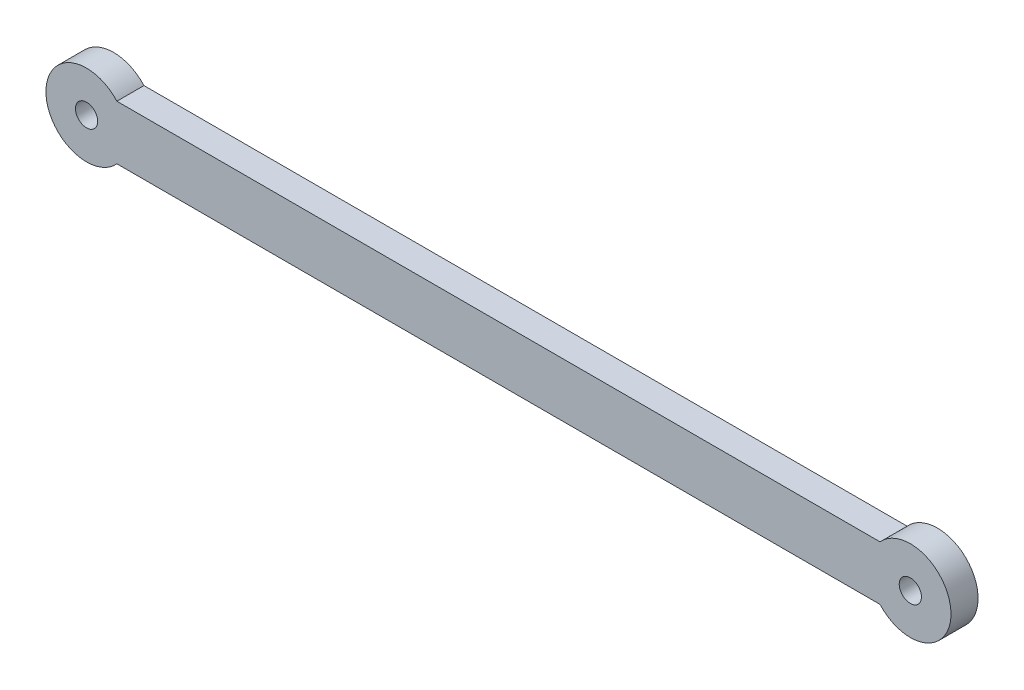
ISO-10303-21;
HEADER;
FILE_DESCRIPTION(('STEP AP214'),'2;1');
FILE_NAME('part.step','',(''),(''),'','','');
FILE_SCHEMA(('AUTOMOTIVE_DESIGN { 1 0 10303 214 1 1 1 1 }'));
ENDSEC;
DATA;
#1=APPLICATION_CONTEXT('core data for automotive mechanical design processes');
#2=APPLICATION_PROTOCOL_DEFINITION('international standard','automotive_design',2000,#1);
#3=PRODUCT_CONTEXT('',#1,'mechanical');
#4=PRODUCT('Part','Part','',(#3));
#5=PRODUCT_RELATED_PRODUCT_CATEGORY('part','',(#4));
#6=PRODUCT_DEFINITION_FORMATION('','',#4);
#7=PRODUCT_DEFINITION_CONTEXT('part definition',#1,'design');
#8=PRODUCT_DEFINITION('design','',#6,#7);
#9=PRODUCT_DEFINITION_SHAPE('','',#8);
#10=(LENGTH_UNIT() NAMED_UNIT(*) SI_UNIT(.MILLI.,.METRE.));
#11=(NAMED_UNIT(*) PLANE_ANGLE_UNIT() SI_UNIT($,.RADIAN.));
#12=(NAMED_UNIT(*) SI_UNIT($,.STERADIAN.) SOLID_ANGLE_UNIT());
#13=UNCERTAINTY_MEASURE_WITH_UNIT(LENGTH_MEASURE(1.E-05),#10,'distance_accuracy_value','');
#14=(GEOMETRIC_REPRESENTATION_CONTEXT(3) GLOBAL_UNCERTAINTY_ASSIGNED_CONTEXT((#13)) GLOBAL_UNIT_ASSIGNED_CONTEXT((#10,
#11,#12)) REPRESENTATION_CONTEXT('',''));
#15=CARTESIAN_POINT('',(0.,0.,0.));
#16=DIRECTION('',(0.,0.,1.));
#17=DIRECTION('',(1.,0.,0.));
#18=AXIS2_PLACEMENT_3D('',#15,#16,#17);
#19=CARTESIAN_POINT('',(0.,0.,5.));
#20=DIRECTION('',(0.,0.,1.));
#21=DIRECTION('',(1.,0.,0.));
#22=AXIS2_PLACEMENT_3D('',#19,#20,#21);
#23=PLANE('',#22);
#24=CARTESIAN_POINT('',(0.,0.,5.));
#25=DIRECTION('',(0.,0.,1.));
#26=DIRECTION('',(1.,0.,0.));
#27=AXIS2_PLACEMENT_3D('',#24,#25,#26);
#28=CIRCLE('',#27,2.05);
#29=CARTESIAN_POINT('',(2.05,0.,5.));
#30=VERTEX_POINT('',#29);
#31=EDGE_CURVE('E104',#30,#30,#28,.T.);
#32=ORIENTED_EDGE('',*,*,#31,.F.);
#33=EDGE_LOOP('',(#32));
#34=FACE_BOUND('',#33,.T.);
#35=CARTESIAN_POINT('',(0.,0.,5.));
#36=DIRECTION('',(0.,0.,1.));
#37=DIRECTION('',(1.,0.,0.));
#38=AXIS2_PLACEMENT_3D('',#35,#36,#37);
#39=CIRCLE('',#38,7.5);
#40=CARTESIAN_POINT('',(5.59016994374947,5.,5.));
#41=VERTEX_POINT('',#40);
#42=CARTESIAN_POINT('',(5.59016994374947,-5.,5.));
#43=VERTEX_POINT('',#42);
#44=EDGE_CURVE('E89',#41,#43,#39,.T.);
#45=ORIENTED_EDGE('',*,*,#44,.T.);
#46=DIRECTION('',(1.,0.,0.));
#47=VECTOR('',#46,1.);
#48=CARTESIAN_POINT('',(5.59016994374947,-5.,5.));
#49=LINE('',#48,#47);
#50=CARTESIAN_POINT('',(146.409830056251,-5.,5.));
#51=VERTEX_POINT('',#50);
#52=EDGE_CURVE('E84',#43,#51,#49,.T.);
#53=ORIENTED_EDGE('',*,*,#52,.T.);
#54=CARTESIAN_POINT('',(152.,0.,5.));
#55=DIRECTION('',(0.,0.,1.));
#56=DIRECTION('',(1.,0.,0.));
#57=AXIS2_PLACEMENT_3D('',#54,#55,#56);
#58=CIRCLE('',#57,7.5);
#59=CARTESIAN_POINT('',(146.409830056251,5.,5.));
#60=VERTEX_POINT('',#59);
#61=EDGE_CURVE('E87',#51,#60,#58,.T.);
#62=ORIENTED_EDGE('',*,*,#61,.T.);
#63=DIRECTION('',(-1.,0.,0.));
#64=VECTOR('',#63,1.);
#65=CARTESIAN_POINT('',(5.59016994374947,5.,5.));
#66=LINE('',#65,#64);
#67=EDGE_CURVE('E54',#60,#41,#66,.T.);
#68=ORIENTED_EDGE('',*,*,#67,.T.);
#69=EDGE_LOOP('',(#45,#53,#62,#68));
#70=FACE_BOUND('',#69,.T.);
#71=CARTESIAN_POINT('',(152.,0.,5.));
#72=DIRECTION('',(0.,0.,1.));
#73=DIRECTION('',(1.,0.,0.));
#74=AXIS2_PLACEMENT_3D('',#71,#72,#73);
#75=CIRCLE('',#74,2.04999999999999);
#76=CARTESIAN_POINT('',(154.05,0.,5.));
#77=VERTEX_POINT('',#76);
#78=EDGE_CURVE('E119',#77,#77,#75,.T.);
#79=ORIENTED_EDGE('',*,*,#78,.F.);
#80=EDGE_LOOP('',(#79));
#81=FACE_BOUND('',#80,.T.);
#82=ADVANCED_FACE('F37',(#34,#70,#81),#23,.T.);
#83=CARTESIAN_POINT('',(0.,0.,0.));
#84=DIRECTION('',(0.,0.,1.));
#85=DIRECTION('',(1.,0.,0.));
#86=AXIS2_PLACEMENT_3D('',#83,#84,#85);
#87=PLANE('',#86);
#88=CARTESIAN_POINT('',(0.,0.,0.));
#89=DIRECTION('',(0.,0.,1.));
#90=DIRECTION('',(1.,0.,0.));
#91=AXIS2_PLACEMENT_3D('',#88,#89,#90);
#92=CIRCLE('',#91,7.5);
#93=CARTESIAN_POINT('',(5.59016994374947,5.,0.));
#94=VERTEX_POINT('',#93);
#95=CARTESIAN_POINT('',(5.59016994374947,-5.,0.));
#96=VERTEX_POINT('',#95);
#97=EDGE_CURVE('E101',#94,#96,#92,.T.);
#98=ORIENTED_EDGE('',*,*,#97,.F.);
#99=DIRECTION('',(-1.,0.,0.));
#100=VECTOR('',#99,1.);
#101=CARTESIAN_POINT('',(5.59016994374947,5.,0.));
#102=LINE('',#101,#100);
#103=CARTESIAN_POINT('',(146.409830056251,5.,0.));
#104=VERTEX_POINT('',#103);
#105=EDGE_CURVE('E77',#104,#94,#102,.T.);
#106=ORIENTED_EDGE('',*,*,#105,.F.);
#107=CARTESIAN_POINT('',(152.,0.,0.));
#108=DIRECTION('',(0.,0.,1.));
#109=DIRECTION('',(1.,0.,0.));
#110=AXIS2_PLACEMENT_3D('',#107,#108,#109);
#111=CIRCLE('',#110,7.5);
#112=CARTESIAN_POINT('',(146.409830056251,-5.,0.));
#113=VERTEX_POINT('',#112);
#114=EDGE_CURVE('E71',#113,#104,#111,.T.);
#115=ORIENTED_EDGE('',*,*,#114,.F.);
#116=DIRECTION('',(1.,0.,0.));
#117=VECTOR('',#116,1.);
#118=CARTESIAN_POINT('',(5.59016994374947,-5.,0.));
#119=LINE('',#118,#117);
#120=EDGE_CURVE('E93',#96,#113,#119,.T.);
#121=ORIENTED_EDGE('',*,*,#120,.F.);
#122=EDGE_LOOP('',(#98,#106,#115,#121));
#123=FACE_BOUND('',#122,.T.);
#124=CARTESIAN_POINT('',(0.,0.,0.));
#125=DIRECTION('',(0.,0.,1.));
#126=DIRECTION('',(1.,0.,0.));
#127=AXIS2_PLACEMENT_3D('',#124,#125,#126);
#128=CIRCLE('',#127,2.05);
#129=CARTESIAN_POINT('',(2.05,0.,0.));
#130=VERTEX_POINT('',#129);
#131=EDGE_CURVE('E116',#130,#130,#128,.T.);
#132=ORIENTED_EDGE('',*,*,#131,.T.);
#133=EDGE_LOOP('',(#132));
#134=FACE_BOUND('',#133,.T.);
#135=CARTESIAN_POINT('',(152.,0.,0.));
#136=DIRECTION('',(0.,0.,1.));
#137=DIRECTION('',(1.,0.,0.));
#138=AXIS2_PLACEMENT_3D('',#135,#136,#137);
#139=CIRCLE('',#138,2.04999999999999);
#140=CARTESIAN_POINT('',(154.05,0.,0.));
#141=VERTEX_POINT('',#140);
#142=EDGE_CURVE('E122',#141,#141,#139,.T.);
#143=ORIENTED_EDGE('',*,*,#142,.T.);
#144=EDGE_LOOP('',(#143));
#145=FACE_BOUND('',#144,.T.);
#146=ADVANCED_FACE('F112',(#123,#134,#145),#87,.F.);
#147=CARTESIAN_POINT('',(0.,0.,5.));
#148=DIRECTION('',(0.,0.,-1.));
#149=DIRECTION('',(-1.,0.,0.));
#150=AXIS2_PLACEMENT_3D('',#147,#148,#149);
#151=CYLINDRICAL_SURFACE('',#150,7.5);
#152=ORIENTED_EDGE('',*,*,#97,.T.);
#153=DIRECTION('',(0.,0.,-1.));
#154=VECTOR('',#153,1.);
#155=CARTESIAN_POINT('',(5.59016994374947,-5.,5.));
#156=LINE('',#155,#154);
#157=EDGE_CURVE('E11',#43,#96,#156,.T.);
#158=ORIENTED_EDGE('',*,*,#157,.F.);
#159=ORIENTED_EDGE('',*,*,#44,.F.);
#160=DIRECTION('',(0.,0.,-1.));
#161=VECTOR('',#160,1.);
#162=CARTESIAN_POINT('',(5.59016994374947,5.,5.));
#163=LINE('',#162,#161);
#164=EDGE_CURVE('E97',#41,#94,#163,.T.);
#165=ORIENTED_EDGE('',*,*,#164,.T.);
#166=EDGE_LOOP('',(#152,#158,#159,#165));
#167=FACE_BOUND('',#166,.T.);
#168=ADVANCED_FACE('F39',(#167),#151,.T.);
#169=CARTESIAN_POINT('',(5.59016994374947,-5.,5.));
#170=DIRECTION('',(0.,1.,0.));
#171=DIRECTION('',(0.,0.,1.));
#172=AXIS2_PLACEMENT_3D('',#169,#170,#171);
#173=PLANE('',#172);
#174=ORIENTED_EDGE('',*,*,#120,.T.);
#175=DIRECTION('',(0.,0.,-1.));
#176=VECTOR('',#175,1.);
#177=CARTESIAN_POINT('',(146.409830056251,-5.,5.));
#178=LINE('',#177,#176);
#179=EDGE_CURVE('E46',#51,#113,#178,.T.);
#180=ORIENTED_EDGE('',*,*,#179,.F.);
#181=ORIENTED_EDGE('',*,*,#52,.F.);
#182=ORIENTED_EDGE('',*,*,#157,.T.);
#183=EDGE_LOOP('',(#174,#180,#181,#182));
#184=FACE_BOUND('',#183,.T.);
#185=ADVANCED_FACE('F92',(#184),#173,.F.);
#186=CARTESIAN_POINT('',(152.,0.,5.));
#187=DIRECTION('',(0.,0.,-1.));
#188=DIRECTION('',(-1.,0.,0.));
#189=AXIS2_PLACEMENT_3D('',#186,#187,#188);
#190=CYLINDRICAL_SURFACE('',#189,7.5);
#191=ORIENTED_EDGE('',*,*,#114,.T.);
#192=DIRECTION('',(0.,0.,-1.));
#193=VECTOR('',#192,1.);
#194=CARTESIAN_POINT('',(146.409830056251,5.,5.));
#195=LINE('',#194,#193);
#196=EDGE_CURVE('E94',#60,#104,#195,.T.);
#197=ORIENTED_EDGE('',*,*,#196,.F.);
#198=ORIENTED_EDGE('',*,*,#61,.F.);
#199=ORIENTED_EDGE('',*,*,#179,.T.);
#200=EDGE_LOOP('',(#191,#197,#198,#199));
#201=FACE_BOUND('',#200,.T.);
#202=ADVANCED_FACE('F95',(#201),#190,.T.);
#203=CARTESIAN_POINT('',(5.59016994374947,5.,5.));
#204=DIRECTION('',(0.,-1.,0.));
#205=DIRECTION('',(0.,0.,-1.));
#206=AXIS2_PLACEMENT_3D('',#203,#204,#205);
#207=PLANE('',#206);
#208=ORIENTED_EDGE('',*,*,#105,.T.);
#209=ORIENTED_EDGE('',*,*,#164,.F.);
#210=ORIENTED_EDGE('',*,*,#67,.F.);
#211=ORIENTED_EDGE('',*,*,#196,.T.);
#212=EDGE_LOOP('',(#208,#209,#210,#211));
#213=FACE_BOUND('',#212,.T.);
#214=ADVANCED_FACE('F109',(#213),#207,.F.);
#215=CARTESIAN_POINT('',(0.,0.,5.));
#216=DIRECTION('',(0.,0.,-1.));
#217=DIRECTION('',(-1.,0.,0.));
#218=AXIS2_PLACEMENT_3D('',#215,#216,#217);
#219=CYLINDRICAL_SURFACE('',#218,2.05);
#220=ORIENTED_EDGE('',*,*,#31,.T.);
#221=EDGE_LOOP('',(#220));
#222=FACE_BOUND('',#221,.T.);
#223=ORIENTED_EDGE('',*,*,#131,.F.);
#224=EDGE_LOOP('',(#223));
#225=FACE_BOUND('',#224,.T.);
#226=ADVANCED_FACE('F139',(#222,#225),#219,.F.);
#227=CARTESIAN_POINT('',(152.,0.,5.));
#228=DIRECTION('',(0.,0.,-1.));
#229=DIRECTION('',(-1.,0.,0.));
#230=AXIS2_PLACEMENT_3D('',#227,#228,#229);
#231=CYLINDRICAL_SURFACE('',#230,2.04999999999999);
#232=ORIENTED_EDGE('',*,*,#78,.T.);
#233=EDGE_LOOP('',(#232));
#234=FACE_BOUND('',#233,.T.);
#235=ORIENTED_EDGE('',*,*,#142,.F.);
#236=EDGE_LOOP('',(#235));
#237=FACE_BOUND('',#236,.T.);
#238=ADVANCED_FACE('F128',(#234,#237),#231,.F.);
#239=CLOSED_SHELL('',(#82,#146,#168,#185,#202,#214,#226,#238));
#240=MANIFOLD_SOLID_BREP('B2',#239);
#241=ADVANCED_BREP_SHAPE_REPRESENTATION('',(#18,#240),#14);
#242=SHAPE_DEFINITION_REPRESENTATION(#9,#241);
ENDSEC;
END-ISO-10303-21;
